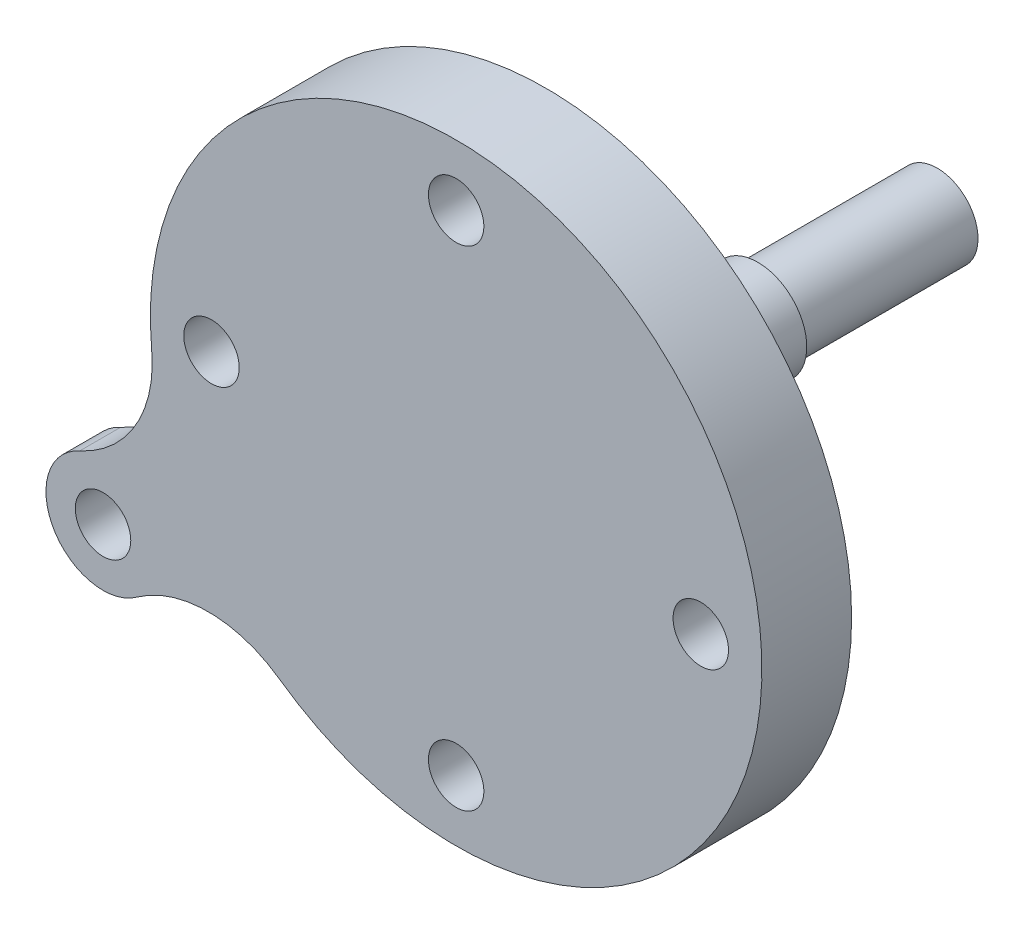
ISO-10303-21;
HEADER;
FILE_DESCRIPTION(('STEP AP214'),'2;1');
FILE_NAME('part.step','',(''),(''),'','','');
FILE_SCHEMA(('AUTOMOTIVE_DESIGN { 1 0 10303 214 1 1 1 1 }'));
ENDSEC;
DATA;
#1=APPLICATION_CONTEXT('core data for automotive mechanical design processes');
#2=APPLICATION_PROTOCOL_DEFINITION('international standard','automotive_design',2000,#1);
#3=PRODUCT_CONTEXT('',#1,'mechanical');
#4=PRODUCT('Part','Part','',(#3));
#5=PRODUCT_RELATED_PRODUCT_CATEGORY('part','',(#4));
#6=PRODUCT_DEFINITION_FORMATION('','',#4);
#7=PRODUCT_DEFINITION_CONTEXT('part definition',#1,'design');
#8=PRODUCT_DEFINITION('design','',#6,#7);
#9=PRODUCT_DEFINITION_SHAPE('','',#8);
#10=(LENGTH_UNIT() NAMED_UNIT(*) SI_UNIT(.MILLI.,.METRE.));
#11=(NAMED_UNIT(*) PLANE_ANGLE_UNIT() SI_UNIT($,.RADIAN.));
#12=(NAMED_UNIT(*) SI_UNIT($,.STERADIAN.) SOLID_ANGLE_UNIT());
#13=UNCERTAINTY_MEASURE_WITH_UNIT(LENGTH_MEASURE(1.E-05),#10,'distance_accuracy_value','');
#14=(GEOMETRIC_REPRESENTATION_CONTEXT(3) GLOBAL_UNCERTAINTY_ASSIGNED_CONTEXT((#13)) GLOBAL_UNIT_ASSIGNED_CONTEXT((#10,
#11,#12)) REPRESENTATION_CONTEXT('',''));
#15=CARTESIAN_POINT('',(0.,0.,0.));
#16=DIRECTION('',(0.,0.,1.));
#17=DIRECTION('',(1.,0.,0.));
#18=AXIS2_PLACEMENT_3D('',#15,#16,#17);
#19=CARTESIAN_POINT('',(0.,0.,11.));
#20=DIRECTION('',(0.,0.,-1.));
#21=DIRECTION('',(-1.,0.,0.));
#22=AXIS2_PLACEMENT_3D('',#19,#20,#21);
#23=CYLINDRICAL_SURFACE('',#22,37.5);
#24=CARTESIAN_POINT('',(0.,0.,0.));
#25=DIRECTION('',(0.,0.,1.));
#26=DIRECTION('',(1.,0.,0.));
#27=AXIS2_PLACEMENT_3D('',#24,#25,#26);
#28=CIRCLE('',#27,37.5);
#29=CARTESIAN_POINT('',(37.5,0.,0.));
#30=VERTEX_POINT('',#29);
#31=EDGE_CURVE('E206',#30,#30,#28,.T.);
#32=ORIENTED_EDGE('',*,*,#31,.T.);
#33=EDGE_LOOP('',(#32));
#34=FACE_BOUND('',#33,.T.);
#35=DIRECTION('',(0.,0.,1.));
#36=VECTOR('',#35,1.);
#37=CARTESIAN_POINT('',(-21.7057138285215,-30.5796008344506,6.));
#38=LINE('',#37,#36);
#39=CARTESIAN_POINT('',(-21.7057138285215,-30.5796008344506,6.));
#40=VERTEX_POINT('',#39);
#41=CARTESIAN_POINT('',(-21.7057138285215,-30.5796008344506,11.));
#42=VERTEX_POINT('',#41);
#43=EDGE_CURVE('E122',#40,#42,#38,.T.);
#44=ORIENTED_EDGE('',*,*,#43,.F.);
#45=CARTESIAN_POINT('',(0.,0.,6.));
#46=DIRECTION('',(0.,0.,-1.));
#47=DIRECTION('',(1.,0.,0.));
#48=AXIS2_PLACEMENT_3D('',#45,#46,#47);
#49=CIRCLE('',#48,37.5);
#50=CARTESIAN_POINT('',(-37.3355680744828,-3.50789916554908,6.));
#51=VERTEX_POINT('',#50);
#52=EDGE_CURVE('E108',#40,#51,#49,.T.);
#53=ORIENTED_EDGE('',*,*,#52,.T.);
#54=DIRECTION('',(0.,0.,1.));
#55=VECTOR('',#54,1.);
#56=CARTESIAN_POINT('',(-37.3355680744828,-3.50789916554908,6.));
#57=LINE('',#56,#55);
#58=CARTESIAN_POINT('',(-37.3355680744828,-3.50789916554908,11.));
#59=VERTEX_POINT('',#58);
#60=EDGE_CURVE('E128',#51,#59,#57,.T.);
#61=ORIENTED_EDGE('',*,*,#60,.T.);
#62=CARTESIAN_POINT('',(0.,0.,11.));
#63=DIRECTION('',(0.,0.,1.));
#64=DIRECTION('',(1.,0.,0.));
#65=AXIS2_PLACEMENT_3D('',#62,#63,#64);
#66=CIRCLE('',#65,37.5);
#67=EDGE_CURVE('E127',#42,#59,#66,.T.);
#68=ORIENTED_EDGE('',*,*,#67,.F.);
#69=EDGE_LOOP('',(#44,#53,#61,#68));
#70=FACE_BOUND('',#69,.T.);
#71=ADVANCED_FACE('F36',(#34,#70),#23,.T.);
#72=CARTESIAN_POINT('',(0.,0.,11.));
#73=DIRECTION('',(0.,0.,1.));
#74=DIRECTION('',(1.,0.,0.));
#75=AXIS2_PLACEMENT_3D('',#72,#73,#74);
#76=PLANE('',#75);
#77=CARTESIAN_POINT('',(-43.3012701892221,-24.9999999999998,11.));
#78=DIRECTION('',(0.,0.,1.));
#79=DIRECTION('',(1.,0.,0.));
#80=AXIS2_PLACEMENT_3D('',#77,#78,#79);
#81=CIRCLE('',#80,3.4);
#82=CARTESIAN_POINT('',(-39.9012701892221,-24.9999999999998,11.));
#83=VERTEX_POINT('',#82);
#84=EDGE_CURVE('E432',#83,#83,#81,.T.);
#85=ORIENTED_EDGE('',*,*,#84,.F.);
#86=EDGE_LOOP('',(#85));
#87=FACE_BOUND('',#86,.T.);
#88=CARTESIAN_POINT('',(0.,30.,11.));
#89=DIRECTION('',(0.,0.,1.));
#90=DIRECTION('',(1.,0.,0.));
#91=AXIS2_PLACEMENT_3D('',#88,#89,#90);
#92=CIRCLE('',#91,3.4);
#93=CARTESIAN_POINT('',(3.4,30.,11.));
#94=VERTEX_POINT('',#93);
#95=EDGE_CURVE('E182',#94,#94,#92,.T.);
#96=ORIENTED_EDGE('',*,*,#95,.F.);
#97=EDGE_LOOP('',(#96));
#98=FACE_BOUND('',#97,.T.);
#99=CARTESIAN_POINT('',(30.,0.,11.));
#100=DIRECTION('',(0.,0.,1.));
#101=DIRECTION('',(1.,0.,0.));
#102=AXIS2_PLACEMENT_3D('',#99,#100,#101);
#103=CIRCLE('',#102,3.39999999999999);
#104=CARTESIAN_POINT('',(33.4,0.,11.));
#105=VERTEX_POINT('',#104);
#106=EDGE_CURVE('E188',#105,#105,#103,.T.);
#107=ORIENTED_EDGE('',*,*,#106,.F.);
#108=EDGE_LOOP('',(#107));
#109=FACE_BOUND('',#108,.T.);
#110=CARTESIAN_POINT('',(0.,-30.,11.));
#111=DIRECTION('',(0.,0.,1.));
#112=DIRECTION('',(1.,0.,0.));
#113=AXIS2_PLACEMENT_3D('',#110,#111,#112);
#114=CIRCLE('',#113,3.4);
#115=CARTESIAN_POINT('',(3.4,-30.,11.));
#116=VERTEX_POINT('',#115);
#117=EDGE_CURVE('E194',#116,#116,#114,.T.);
#118=ORIENTED_EDGE('',*,*,#117,.F.);
#119=EDGE_LOOP('',(#118));
#120=FACE_BOUND('',#119,.T.);
#121=CARTESIAN_POINT('',(-30.,0.,11.));
#122=DIRECTION('',(0.,0.,1.));
#123=DIRECTION('',(1.,0.,0.));
#124=AXIS2_PLACEMENT_3D('',#121,#122,#123);
#125=CIRCLE('',#124,3.4);
#126=CARTESIAN_POINT('',(-26.6,0.,11.));
#127=VERTEX_POINT('',#126);
#128=EDGE_CURVE('E200',#127,#127,#125,.T.);
#129=ORIENTED_EDGE('',*,*,#128,.F.);
#130=EDGE_LOOP('',(#129));
#131=FACE_BOUND('',#130,.T.);
#132=ORIENTED_EDGE('',*,*,#67,.T.);
#133=CARTESIAN_POINT('',(-52.2697953042759,-4.91105883176871,11.));
#134=DIRECTION('',(0.,0.,-1.));
#135=DIRECTION('',(1.,0.,0.));
#136=AXIS2_PLACEMENT_3D('',#133,#134,#135);
#137=CIRCLE('',#136,15.);
#138=CARTESIAN_POINT('',(-46.1548918167392,-18.6080641737444,11.));
#139=VERTEX_POINT('',#138);
#140=EDGE_CURVE('E435',#59,#139,#137,.T.);
#141=ORIENTED_EDGE('',*,*,#140,.T.);
#142=CARTESIAN_POINT('',(-43.3012701892221,-24.9999999999998,11.));
#143=DIRECTION('',(0.,0.,1.));
#144=DIRECTION('',(1.,0.,0.));
#145=AXIS2_PLACEMENT_3D('',#142,#143,#144);
#146=CIRCLE('',#145,6.99999999999999);
#147=CARTESIAN_POINT('',(-39.1925021980837,-30.667276735346,11.));
#148=VERTEX_POINT('',#147);
#149=EDGE_CURVE('E125',#139,#148,#146,.T.);
#150=ORIENTED_EDGE('',*,*,#149,.T.);
#151=CARTESIAN_POINT('',(-30.3879993599301,-42.8114411682308,11.));
#152=DIRECTION('',(0.,0.,-1.));
#153=DIRECTION('',(1.,0.,0.));
#154=AXIS2_PLACEMENT_3D('',#151,#152,#153);
#155=CIRCLE('',#154,15.);
#156=EDGE_CURVE('E51',#148,#42,#155,.T.);
#157=ORIENTED_EDGE('',*,*,#156,.T.);
#158=EDGE_LOOP('',(#132,#141,#150,#157));
#159=FACE_BOUND('',#158,.T.);
#160=ADVANCED_FACE('F252',(#87,#98,#109,#120,#131,#159),#76,.T.);
#161=CARTESIAN_POINT('',(0.,0.,0.));
#162=DIRECTION('',(0.,0.,1.));
#163=DIRECTION('',(1.,0.,0.));
#164=AXIS2_PLACEMENT_3D('',#161,#162,#163);
#165=PLANE('',#164);
#166=CARTESIAN_POINT('',(0.,0.,0.));
#167=DIRECTION('',(0.,0.,1.));
#168=DIRECTION('',(1.,0.,0.));
#169=AXIS2_PLACEMENT_3D('',#166,#167,#168);
#170=CIRCLE('',#169,12.);
#171=CARTESIAN_POINT('',(12.,0.,0.));
#172=VERTEX_POINT('',#171);
#173=EDGE_CURVE('E179',#172,#172,#170,.F.);
#174=ORIENTED_EDGE('',*,*,#173,.F.);
#175=EDGE_LOOP('',(#174));
#176=FACE_BOUND('',#175,.T.);
#177=CARTESIAN_POINT('',(0.,30.,0.));
#178=DIRECTION('',(0.,0.,1.));
#179=DIRECTION('',(1.,0.,0.));
#180=AXIS2_PLACEMENT_3D('',#177,#178,#179);
#181=CIRCLE('',#180,3.4);
#182=CARTESIAN_POINT('',(3.4,30.,0.));
#183=VERTEX_POINT('',#182);
#184=EDGE_CURVE('E185',#183,#183,#181,.T.);
#185=ORIENTED_EDGE('',*,*,#184,.T.);
#186=EDGE_LOOP('',(#185));
#187=FACE_BOUND('',#186,.T.);
#188=CARTESIAN_POINT('',(30.,0.,0.));
#189=DIRECTION('',(0.,0.,1.));
#190=DIRECTION('',(1.,0.,0.));
#191=AXIS2_PLACEMENT_3D('',#188,#189,#190);
#192=CIRCLE('',#191,3.39999999999999);
#193=CARTESIAN_POINT('',(33.4,0.,0.));
#194=VERTEX_POINT('',#193);
#195=EDGE_CURVE('E191',#194,#194,#192,.T.);
#196=ORIENTED_EDGE('',*,*,#195,.T.);
#197=EDGE_LOOP('',(#196));
#198=FACE_BOUND('',#197,.T.);
#199=CARTESIAN_POINT('',(0.,-30.,0.));
#200=DIRECTION('',(0.,0.,1.));
#201=DIRECTION('',(1.,0.,0.));
#202=AXIS2_PLACEMENT_3D('',#199,#200,#201);
#203=CIRCLE('',#202,3.4);
#204=CARTESIAN_POINT('',(3.4,-30.,0.));
#205=VERTEX_POINT('',#204);
#206=EDGE_CURVE('E197',#205,#205,#203,.T.);
#207=ORIENTED_EDGE('',*,*,#206,.T.);
#208=EDGE_LOOP('',(#207));
#209=FACE_BOUND('',#208,.T.);
#210=CARTESIAN_POINT('',(-30.,0.,0.));
#211=DIRECTION('',(0.,0.,1.));
#212=DIRECTION('',(1.,0.,0.));
#213=AXIS2_PLACEMENT_3D('',#210,#211,#212);
#214=CIRCLE('',#213,3.4);
#215=CARTESIAN_POINT('',(-26.6,0.,0.));
#216=VERTEX_POINT('',#215);
#217=EDGE_CURVE('E203',#216,#216,#214,.T.);
#218=ORIENTED_EDGE('',*,*,#217,.T.);
#219=EDGE_LOOP('',(#218));
#220=FACE_BOUND('',#219,.T.);
#221=ORIENTED_EDGE('',*,*,#31,.F.);
#222=EDGE_LOOP('',(#221));
#223=FACE_BOUND('',#222,.T.);
#224=ADVANCED_FACE('F257',(#176,#187,#198,#209,#220,#223),#165,.F.);
#225=CARTESIAN_POINT('',(-30.,0.,11.));
#226=DIRECTION('',(0.,0.,1.));
#227=DIRECTION('',(1.,0.,0.));
#228=AXIS2_PLACEMENT_3D('',#225,#226,#227);
#229=CYLINDRICAL_SURFACE('',#228,3.4);
#230=ORIENTED_EDGE('',*,*,#128,.T.);
#231=EDGE_LOOP('',(#230));
#232=FACE_BOUND('',#231,.T.);
#233=ORIENTED_EDGE('',*,*,#217,.F.);
#234=EDGE_LOOP('',(#233));
#235=FACE_BOUND('',#234,.T.);
#236=ADVANCED_FACE('F263',(#232,#235),#229,.F.);
#237=CARTESIAN_POINT('',(0.,-30.,11.));
#238=DIRECTION('',(0.,0.,1.));
#239=DIRECTION('',(1.,0.,0.));
#240=AXIS2_PLACEMENT_3D('',#237,#238,#239);
#241=CYLINDRICAL_SURFACE('',#240,3.4);
#242=ORIENTED_EDGE('',*,*,#117,.T.);
#243=EDGE_LOOP('',(#242));
#244=FACE_BOUND('',#243,.T.);
#245=ORIENTED_EDGE('',*,*,#206,.F.);
#246=EDGE_LOOP('',(#245));
#247=FACE_BOUND('',#246,.T.);
#248=ADVANCED_FACE('F268',(#244,#247),#241,.F.);
#249=CARTESIAN_POINT('',(30.,0.,11.));
#250=DIRECTION('',(0.,0.,1.));
#251=DIRECTION('',(1.,0.,0.));
#252=AXIS2_PLACEMENT_3D('',#249,#250,#251);
#253=CYLINDRICAL_SURFACE('',#252,3.39999999999999);
#254=ORIENTED_EDGE('',*,*,#106,.T.);
#255=EDGE_LOOP('',(#254));
#256=FACE_BOUND('',#255,.T.);
#257=ORIENTED_EDGE('',*,*,#195,.F.);
#258=EDGE_LOOP('',(#257));
#259=FACE_BOUND('',#258,.T.);
#260=ADVANCED_FACE('F276',(#256,#259),#253,.F.);
#261=CARTESIAN_POINT('',(0.,30.,11.));
#262=DIRECTION('',(0.,0.,1.));
#263=DIRECTION('',(1.,0.,0.));
#264=AXIS2_PLACEMENT_3D('',#261,#262,#263);
#265=CYLINDRICAL_SURFACE('',#264,3.4);
#266=ORIENTED_EDGE('',*,*,#95,.T.);
#267=EDGE_LOOP('',(#266));
#268=FACE_BOUND('',#267,.T.);
#269=ORIENTED_EDGE('',*,*,#184,.F.);
#270=EDGE_LOOP('',(#269));
#271=FACE_BOUND('',#270,.T.);
#272=ADVANCED_FACE('F280',(#268,#271),#265,.F.);
#273=CARTESIAN_POINT('',(0.,0.,-1.));
#274=DIRECTION('',(0.,0.,1.));
#275=DIRECTION('',(1.,0.,0.));
#276=AXIS2_PLACEMENT_3D('',#273,#274,#275);
#277=CYLINDRICAL_SURFACE('',#276,12.);
#278=CARTESIAN_POINT('',(0.,0.,-1.));
#279=DIRECTION('',(0.,0.,-1.));
#280=DIRECTION('',(-1.,0.,0.));
#281=AXIS2_PLACEMENT_3D('',#278,#279,#280);
#282=CIRCLE('',#281,12.);
#283=CARTESIAN_POINT('',(-12.,0.,-1.));
#284=VERTEX_POINT('',#283);
#285=EDGE_CURVE('E176',#284,#284,#282,.T.);
#286=ORIENTED_EDGE('',*,*,#285,.F.);
#287=EDGE_LOOP('',(#286));
#288=FACE_BOUND('',#287,.T.);
#289=ORIENTED_EDGE('',*,*,#173,.T.);
#290=EDGE_LOOP('',(#289));
#291=FACE_BOUND('',#290,.T.);
#292=ADVANCED_FACE('F284',(#288,#291),#277,.T.);
#293=CARTESIAN_POINT('',(0.,0.,-1.));
#294=DIRECTION('',(0.,0.,-1.));
#295=DIRECTION('',(-1.,0.,0.));
#296=AXIS2_PLACEMENT_3D('',#293,#294,#295);
#297=PLANE('',#296);
#298=CARTESIAN_POINT('',(0.,0.,-1.));
#299=DIRECTION('',(0.,0.,-1.));
#300=DIRECTION('',(-1.,0.,0.));
#301=AXIS2_PLACEMENT_3D('',#298,#299,#300);
#302=CIRCLE('',#301,10.);
#303=CARTESIAN_POINT('',(-10.,0.,-1.));
#304=VERTEX_POINT('',#303);
#305=EDGE_CURVE('E173',#304,#304,#302,.T.);
#306=ORIENTED_EDGE('',*,*,#305,.F.);
#307=EDGE_LOOP('',(#306));
#308=FACE_BOUND('',#307,.T.);
#309=ORIENTED_EDGE('',*,*,#285,.T.);
#310=EDGE_LOOP('',(#309));
#311=FACE_BOUND('',#310,.T.);
#312=ADVANCED_FACE('F288',(#308,#311),#297,.T.);
#313=CARTESIAN_POINT('',(0.,0.,-12.));
#314=DIRECTION('',(0.,0.,1.));
#315=DIRECTION('',(1.,0.,0.));
#316=AXIS2_PLACEMENT_3D('',#313,#314,#315);
#317=CYLINDRICAL_SURFACE('',#316,10.);
#318=CARTESIAN_POINT('',(0.,0.,-12.));
#319=DIRECTION('',(0.,0.,-1.));
#320=DIRECTION('',(-1.,0.,0.));
#321=AXIS2_PLACEMENT_3D('',#318,#319,#320);
#322=CIRCLE('',#321,10.);
#323=CARTESIAN_POINT('',(-10.,0.,-12.));
#324=VERTEX_POINT('',#323);
#325=EDGE_CURVE('E170',#324,#324,#322,.T.);
#326=ORIENTED_EDGE('',*,*,#325,.F.);
#327=EDGE_LOOP('',(#326));
#328=FACE_BOUND('',#327,.T.);
#329=ORIENTED_EDGE('',*,*,#305,.T.);
#330=EDGE_LOOP('',(#329));
#331=FACE_BOUND('',#330,.T.);
#332=ADVANCED_FACE('F292',(#328,#331),#317,.T.);
#333=CARTESIAN_POINT('',(0.,0.,-12.));
#334=DIRECTION('',(0.,0.,-1.));
#335=DIRECTION('',(-1.,0.,0.));
#336=AXIS2_PLACEMENT_3D('',#333,#334,#335);
#337=PLANE('',#336);
#338=CARTESIAN_POINT('',(0.,0.,-12.));
#339=DIRECTION('',(0.,0.,-1.));
#340=DIRECTION('',(-1.,0.,0.));
#341=AXIS2_PLACEMENT_3D('',#338,#339,#340);
#342=CIRCLE('',#341,6.);
#343=CARTESIAN_POINT('',(-6.,0.,-12.));
#344=VERTEX_POINT('',#343);
#345=EDGE_CURVE('E167',#344,#344,#342,.T.);
#346=ORIENTED_EDGE('',*,*,#345,.F.);
#347=EDGE_LOOP('',(#346));
#348=FACE_BOUND('',#347,.T.);
#349=ORIENTED_EDGE('',*,*,#325,.T.);
#350=EDGE_LOOP('',(#349));
#351=FACE_BOUND('',#350,.T.);
#352=ADVANCED_FACE('F296',(#348,#351),#337,.T.);
#353=CARTESIAN_POINT('',(0.,0.,-26.));
#354=DIRECTION('',(0.,0.,1.));
#355=DIRECTION('',(1.,0.,0.));
#356=AXIS2_PLACEMENT_3D('',#353,#354,#355);
#357=CYLINDRICAL_SURFACE('',#356,6.);
#358=CARTESIAN_POINT('',(0.,0.,-26.));
#359=DIRECTION('',(0.,0.,-1.));
#360=DIRECTION('',(-1.,0.,0.));
#361=AXIS2_PLACEMENT_3D('',#358,#359,#360);
#362=CIRCLE('',#361,6.);
#363=CARTESIAN_POINT('',(-6.,0.,-26.));
#364=VERTEX_POINT('',#363);
#365=EDGE_CURVE('E162',#364,#364,#362,.T.);
#366=ORIENTED_EDGE('',*,*,#365,.F.);
#367=EDGE_LOOP('',(#366));
#368=FACE_BOUND('',#367,.T.);
#369=ORIENTED_EDGE('',*,*,#345,.T.);
#370=EDGE_LOOP('',(#369));
#371=FACE_BOUND('',#370,.T.);
#372=ADVANCED_FACE('F300',(#368,#371),#357,.T.);
#373=CARTESIAN_POINT('',(0.,0.,-26.));
#374=DIRECTION('',(0.,0.,-1.));
#375=DIRECTION('',(-1.,0.,0.));
#376=AXIS2_PLACEMENT_3D('',#373,#374,#375);
#377=PLANE('',#376);
#378=CARTESIAN_POINT('',(0.,0.,-26.));
#379=DIRECTION('',(0.,0.,-1.));
#380=DIRECTION('',(-1.,0.,0.));
#381=AXIS2_PLACEMENT_3D('',#378,#379,#380);
#382=CIRCLE('',#381,5.);
#383=CARTESIAN_POINT('',(-5.,0.,-26.));
#384=VERTEX_POINT('',#383);
#385=EDGE_CURVE('E163',#384,#384,#382,.T.);
#386=ORIENTED_EDGE('',*,*,#385,.F.);
#387=EDGE_LOOP('',(#386));
#388=FACE_BOUND('',#387,.T.);
#389=ORIENTED_EDGE('',*,*,#365,.T.);
#390=EDGE_LOOP('',(#389));
#391=FACE_BOUND('',#390,.T.);
#392=ADVANCED_FACE('F247',(#388,#391),#377,.T.);
#393=CARTESIAN_POINT('',(0.,0.,-48.));
#394=DIRECTION('',(0.,0.,1.));
#395=DIRECTION('',(1.,0.,0.));
#396=AXIS2_PLACEMENT_3D('',#393,#394,#395);
#397=CYLINDRICAL_SURFACE('',#396,5.);
#398=CARTESIAN_POINT('',(0.,0.,-48.));
#399=DIRECTION('',(0.,0.,-1.));
#400=DIRECTION('',(-1.,0.,0.));
#401=AXIS2_PLACEMENT_3D('',#398,#399,#400);
#402=CIRCLE('',#401,5.);
#403=CARTESIAN_POINT('',(-1.5,-4.76969600708473,-48.));
#404=VERTEX_POINT('',#403);
#405=CARTESIAN_POINT('',(1.5,-4.76969600708473,-48.));
#406=VERTEX_POINT('',#405);
#407=EDGE_CURVE('E159',#404,#406,#402,.T.);
#408=ORIENTED_EDGE('',*,*,#407,.F.);
#409=DIRECTION('',(0.,0.,1.));
#410=VECTOR('',#409,1.);
#411=CARTESIAN_POINT('',(-1.5,-4.76969600708473,-48.));
#412=LINE('',#411,#410);
#413=CARTESIAN_POINT('',(-1.5,-4.76969600708473,-27.9239886957043));
#414=VERTEX_POINT('',#413);
#415=EDGE_CURVE('E150',#404,#414,#412,.T.);
#416=ORIENTED_EDGE('',*,*,#415,.T.);
#417=CARTESIAN_POINT('',(-1.5,-4.76969600708473,-27.9239886957043));
#418=CARTESIAN_POINT('',(-1.50000085357071,-4.76969249084934,-27.8828093027963));
#419=CARTESIAN_POINT('',(-1.49830317083428,-4.77022997000129,-27.8416506525782));
#420=CARTESIAN_POINT('',(-1.49153785660317,-4.77235095109999,-27.7596475336088));
#421=CARTESIAN_POINT('',(-1.48647098275841,-4.77393421787376,-27.7188029963094));
#422=CARTESIAN_POINT('',(-1.46630203689311,-4.78018490618873,-27.5973981547497));
#423=CARTESIAN_POINT('',(-1.44623120413662,-4.78635370384275,-27.517682305288));
#424=CARTESIAN_POINT('',(-1.39353102315626,-4.80195952113208,-27.3629531173185));
#425=CARTESIAN_POINT('',(-1.36090607068203,-4.81139539670393,-27.2879381435063));
#426=CARTESIAN_POINT('',(-1.28407841117655,-4.83246571212052,-27.1443920141067));
#427=CARTESIAN_POINT('',(-1.23987031651226,-4.84410117434933,-27.0758638959759));
#428=CARTESIAN_POINT('',(-1.13964850658326,-4.86866835244721,-26.9451226397073));
#429=CARTESIAN_POINT('',(-1.08333433465208,-4.88162755412974,-26.8831450353609));
#430=CARTESIAN_POINT('',(-0.961138919873354,-4.90714811559049,-26.7693531118044));
#431=CARTESIAN_POINT('',(-0.895256063916348,-4.91970940785249,-26.7175405097013));
#432=CARTESIAN_POINT('',(-0.75410992131543,-4.94333239727705,-26.6245249253858));
#433=CARTESIAN_POINT('',(-0.678680819336259,-4.95435770971354,-26.5835635154064));
#434=CARTESIAN_POINT('',(-0.521621185505774,-4.97334469846208,-26.5150002840862));
#435=CARTESIAN_POINT('',(-0.439992259012927,-4.98130716463903,-26.4873950179101));
#436=CARTESIAN_POINT('',(-0.275324697874877,-4.99307639935002,-26.4471088966023));
#437=CARTESIAN_POINT('',(-0.192393125294253,-4.99699549276993,-26.4340238377346));
#438=CARTESIAN_POINT('',(-0.0254235719980811,-5.00063202022426,-26.4218713543411));
#439=CARTESIAN_POINT('',(0.0586141962423631,-5.00035024971471,-26.4228012760042));
#440=CARTESIAN_POINT('',(0.222571599946018,-4.99569602566267,-26.4383816044633));
#441=CARTESIAN_POINT('',(0.302537145464642,-4.99145415509187,-26.4525940406831));
#442=CARTESIAN_POINT('',(0.458890052102027,-4.9795151369998,-26.4936203309424));
#443=CARTESIAN_POINT('',(0.535277225531999,-4.97181780846028,-26.5204348451603));
#444=CARTESIAN_POINT('',(0.683347815892218,-4.95365214926145,-26.5862009173508));
#445=CARTESIAN_POINT('',(0.754966006044144,-4.94315255692525,-26.6252903400613));
#446=CARTESIAN_POINT('',(0.890765529574422,-4.92049624651755,-26.7143872857527));
#447=CARTESIAN_POINT('',(0.954945191614597,-4.90833915735884,-26.7643972551832));
#448=CARTESIAN_POINT('',(1.07665450541275,-4.88311673571409,-26.8761806837878));
#449=CARTESIAN_POINT('',(1.13383351478034,-4.87003445449554,-26.9383325594651));
#450=CARTESIAN_POINT('',(1.23706769492487,-4.84484215114658,-27.0714861191323));
#451=CARTESIAN_POINT('',(1.28311962013078,-4.83273241337565,-27.1424903760699));
#452=CARTESIAN_POINT('',(1.36316407240863,-4.81077228795653,-27.2922696241536));
#453=CARTESIAN_POINT('',(1.39703006341135,-4.80094596245948,-27.3711158752977));
#454=CARTESIAN_POINT('',(1.45085886004699,-4.78495663653201,-27.5337131996861));
#455=CARTESIAN_POINT('',(1.47084293218035,-4.77878803475875,-27.6174565564187));
#456=CARTESIAN_POINT('',(1.4890120359008,-4.77314032325006,-27.7389835847745));
#457=CARTESIAN_POINT('',(1.49313202989009,-4.77185156275267,-27.7758794298839));
#458=CARTESIAN_POINT('',(1.49862355614854,-4.77012928611782,-27.8498401748039));
#459=CARTESIAN_POINT('',(1.49999912968269,-4.76969451246644,-27.8869047453682));
#460=CARTESIAN_POINT('',(1.5,-4.76969600708473,-27.9239886957043));
#461=B_SPLINE_CURVE_WITH_KNOTS('',3,(#417,#418,#419,#420,#421,#422,#423,#424,#425,#426,#427,
#428,#429,#430,#431,#432,#433,#434,#435,#436,#437,#438,#439,#440,#441,#442,#443,#444,#445,#446,
#447,#448,#449,#450,#451,#452,#453,#454,#455,#456,#457,#458,#459,#460),.UNSPECIFIED.,.F.,.F.,(4,
2,2,2,2,2,2,2,2,2,2,2,2,2,2,2,2,2,2,2,2,4),(0.,0.123459071219734,0.246890388853047,
0.492911349615212,0.738846245884326,0.984895736828095,1.23795510798803,1.49105719006936,
1.74939356197455,2.00766326783256,2.25854751319802,2.5093842528947,2.75223130012966,
2.99509107067836,3.24078242562731,3.48652887757005,3.74172568310981,3.99699683536777,
4.25484698071527,4.51230123440207,4.62365084745809,4.73483637253615),.UNSPECIFIED.);
#462=CARTESIAN_POINT('',(1.5,-4.76969600708473,-27.9239886957043));
#463=VERTEX_POINT('',#462);
#464=EDGE_CURVE('E11',#414,#463,#461,.T.);
#465=ORIENTED_EDGE('',*,*,#464,.T.);
#466=DIRECTION('',(0.,0.,1.));
#467=VECTOR('',#466,1.);
#468=CARTESIAN_POINT('',(1.5,-4.76969600708473,-48.));
#469=LINE('',#468,#467);
#470=EDGE_CURVE('E146',#463,#406,#469,.F.);
#471=ORIENTED_EDGE('',*,*,#470,.T.);
#472=EDGE_LOOP('',(#408,#416,#465,#471));
#473=FACE_BOUND('',#472,.T.);
#474=ORIENTED_EDGE('',*,*,#385,.T.);
#475=EDGE_LOOP('',(#474));
#476=FACE_BOUND('',#475,.T.);
#477=ADVANCED_FACE('F221',(#473,#476),#397,.T.);
#478=CARTESIAN_POINT('',(0.,0.,-48.));
#479=DIRECTION('',(0.,0.,-1.));
#480=DIRECTION('',(-1.,0.,0.));
#481=AXIS2_PLACEMENT_3D('',#478,#479,#480);
#482=PLANE('',#481);
#483=DIRECTION('',(0.,1.,0.));
#484=VECTOR('',#483,1.);
#485=CARTESIAN_POINT('',(-1.5,-13.2,-48.));
#486=LINE('',#485,#484);
#487=CARTESIAN_POINT('',(-1.5,-3.2,-48.));
#488=VERTEX_POINT('',#487);
#489=EDGE_CURVE('E44',#404,#488,#486,.T.);
#490=ORIENTED_EDGE('',*,*,#489,.F.);
#491=ORIENTED_EDGE('',*,*,#407,.T.);
#492=DIRECTION('',(0.,-1.,0.));
#493=VECTOR('',#492,1.);
#494=CARTESIAN_POINT('',(1.5,0.,-48.));
#495=LINE('',#494,#493);
#496=CARTESIAN_POINT('',(1.5,-3.2,-48.));
#497=VERTEX_POINT('',#496);
#498=EDGE_CURVE('E213',#497,#406,#495,.T.);
#499=ORIENTED_EDGE('',*,*,#498,.F.);
#500=DIRECTION('',(1.,0.,0.));
#501=VECTOR('',#500,1.);
#502=CARTESIAN_POINT('',(0.,-3.2,-48.));
#503=LINE('',#502,#501);
#504=EDGE_CURVE('E166',#488,#497,#503,.T.);
#505=ORIENTED_EDGE('',*,*,#504,.F.);
#506=EDGE_LOOP('',(#490,#491,#499,#505));
#507=FACE_BOUND('',#506,.T.);
#508=CARTESIAN_POINT('',(0.,0.,-48.));
#509=DIRECTION('',(0.,0.,-1.));
#510=DIRECTION('',(-1.,0.,0.));
#511=AXIS2_PLACEMENT_3D('',#508,#509,#510);
#512=CIRCLE('',#511,2.5);
#513=CARTESIAN_POINT('',(-2.5,0.,-48.));
#514=VERTEX_POINT('',#513);
#515=EDGE_CURVE('E153',#514,#514,#512,.T.);
#516=ORIENTED_EDGE('',*,*,#515,.F.);
#517=EDGE_LOOP('',(#516));
#518=FACE_BOUND('',#517,.T.);
#519=ADVANCED_FACE('F240',(#507,#518),#482,.T.);
#520=CARTESIAN_POINT('',(0.,0.,-25.));
#521=DIRECTION('',(0.,0.,-1.));
#522=DIRECTION('',(-1.,0.,0.));
#523=AXIS2_PLACEMENT_3D('',#520,#521,#522);
#524=CONICAL_SURFACE('',#523,2.49999999999999,1.02974425867665);
#525=CARTESIAN_POINT('',(0.,0.,-23.4978484524311));
#526=VERTEX_POINT('',#525);
#527=VERTEX_LOOP('',#526);
#528=FACE_BOUND('',#527,.T.);
#529=CARTESIAN_POINT('',(0.,0.,-25.));
#530=DIRECTION('',(0.,0.,-1.));
#531=DIRECTION('',(-1.,0.,0.));
#532=AXIS2_PLACEMENT_3D('',#529,#530,#531);
#533=CIRCLE('',#532,2.49999999999999);
#534=CARTESIAN_POINT('',(-2.49999999999999,0.,-25.));
#535=VERTEX_POINT('',#534);
#536=EDGE_CURVE('E156',#535,#535,#533,.T.);
#537=ORIENTED_EDGE('',*,*,#536,.T.);
#538=EDGE_LOOP('',(#537));
#539=FACE_BOUND('',#538,.T.);
#540=ADVANCED_FACE('F237',(#528,#539),#524,.F.);
#541=CARTESIAN_POINT('',(0.,0.,-48.));
#542=DIRECTION('',(0.,0.,-1.));
#543=DIRECTION('',(-1.,0.,0.));
#544=AXIS2_PLACEMENT_3D('',#541,#542,#543);
#545=CYLINDRICAL_SURFACE('',#544,2.5);
#546=ORIENTED_EDGE('',*,*,#536,.F.);
#547=EDGE_LOOP('',(#546));
#548=FACE_BOUND('',#547,.T.);
#549=ORIENTED_EDGE('',*,*,#515,.T.);
#550=EDGE_LOOP('',(#549));
#551=FACE_BOUND('',#550,.T.);
#552=ADVANCED_FACE('F231',(#548,#551),#545,.F.);
#553=CARTESIAN_POINT('',(0.,-13.2,-27.9239886957043));
#554=DIRECTION('',(0.,1.,0.));
#555=DIRECTION('',(0.,0.,1.));
#556=AXIS2_PLACEMENT_3D('',#553,#554,#555);
#557=CYLINDRICAL_SURFACE('',#556,1.5);
#558=DIRECTION('',(0.,1.,0.));
#559=VECTOR('',#558,1.);
#560=CARTESIAN_POINT('',(-1.5,-13.2,-27.9239886957043));
#561=LINE('',#560,#559);
#562=CARTESIAN_POINT('',(-1.5,-3.2,-27.9239886957043));
#563=VERTEX_POINT('',#562);
#564=EDGE_CURVE('E144',#414,#563,#561,.T.);
#565=ORIENTED_EDGE('',*,*,#564,.T.);
#566=CARTESIAN_POINT('',(0.,-3.2,-27.9239886957043));
#567=DIRECTION('',(0.,1.,0.));
#568=DIRECTION('',(0.,0.,1.));
#569=AXIS2_PLACEMENT_3D('',#566,#567,#568);
#570=CIRCLE('',#569,1.5);
#571=CARTESIAN_POINT('',(1.5,-3.2,-27.9239886957043));
#572=VERTEX_POINT('',#571);
#573=EDGE_CURVE('E136',#563,#572,#570,.T.);
#574=ORIENTED_EDGE('',*,*,#573,.T.);
#575=DIRECTION('',(0.,1.,0.));
#576=VECTOR('',#575,1.);
#577=CARTESIAN_POINT('',(1.5,-13.2,-27.9239886957043));
#578=LINE('',#577,#576);
#579=EDGE_CURVE('E143',#463,#572,#578,.T.);
#580=ORIENTED_EDGE('',*,*,#579,.F.);
#581=ORIENTED_EDGE('',*,*,#464,.F.);
#582=EDGE_LOOP('',(#565,#574,#580,#581));
#583=FACE_BOUND('',#582,.T.);
#584=ADVANCED_FACE('F225',(#583),#557,.F.);
#585=CARTESIAN_POINT('',(-1.5,-13.2,-27.9239886957043));
#586=DIRECTION('',(-1.,0.,0.));
#587=DIRECTION('',(0.,0.,1.));
#588=AXIS2_PLACEMENT_3D('',#585,#586,#587);
#589=PLANE('',#588);
#590=ORIENTED_EDGE('',*,*,#489,.T.);
#591=DIRECTION('',(0.,0.,1.));
#592=VECTOR('',#591,1.);
#593=CARTESIAN_POINT('',(-1.5,-3.2,-27.9239886957043));
#594=LINE('',#593,#592);
#595=EDGE_CURVE('E59',#488,#563,#594,.T.);
#596=ORIENTED_EDGE('',*,*,#595,.T.);
#597=ORIENTED_EDGE('',*,*,#564,.F.);
#598=ORIENTED_EDGE('',*,*,#415,.F.);
#599=EDGE_LOOP('',(#590,#596,#597,#598));
#600=FACE_BOUND('',#599,.T.);
#601=ADVANCED_FACE('F230',(#600),#589,.F.);
#602=CARTESIAN_POINT('',(1.5,-13.2,-27.9239886957043));
#603=DIRECTION('',(1.,0.,0.));
#604=DIRECTION('',(0.,0.,-1.));
#605=AXIS2_PLACEMENT_3D('',#602,#603,#604);
#606=PLANE('',#605);
#607=ORIENTED_EDGE('',*,*,#579,.T.);
#608=DIRECTION('',(0.,0.,-1.));
#609=VECTOR('',#608,1.);
#610=CARTESIAN_POINT('',(1.5,-3.2,-27.9239886957043));
#611=LINE('',#610,#609);
#612=EDGE_CURVE('E139',#572,#497,#611,.T.);
#613=ORIENTED_EDGE('',*,*,#612,.T.);
#614=ORIENTED_EDGE('',*,*,#498,.T.);
#615=ORIENTED_EDGE('',*,*,#470,.F.);
#616=EDGE_LOOP('',(#607,#613,#614,#615));
#617=FACE_BOUND('',#616,.T.);
#618=ADVANCED_FACE('F233',(#617),#606,.F.);
#619=CARTESIAN_POINT('',(0.,-3.2,-27.9239886957043));
#620=DIRECTION('',(0.,1.,0.));
#621=DIRECTION('',(0.,0.,1.));
#622=AXIS2_PLACEMENT_3D('',#619,#620,#621);
#623=PLANE('',#622);
#624=ORIENTED_EDGE('',*,*,#504,.T.);
#625=ORIENTED_EDGE('',*,*,#612,.F.);
#626=ORIENTED_EDGE('',*,*,#573,.F.);
#627=ORIENTED_EDGE('',*,*,#595,.F.);
#628=EDGE_LOOP('',(#624,#625,#626,#627));
#629=FACE_BOUND('',#628,.T.);
#630=ADVANCED_FACE('F359',(#629),#623,.F.);
#631=CARTESIAN_POINT('',(-30.3879993599301,-42.8114411682308,6.));
#632=DIRECTION('',(0.,0.,1.));
#633=DIRECTION('',(1.,0.,0.));
#634=AXIS2_PLACEMENT_3D('',#631,#632,#633);
#635=CYLINDRICAL_SURFACE('',#634,15.);
#636=ORIENTED_EDGE('',*,*,#156,.F.);
#637=DIRECTION('',(0.,0.,1.));
#638=VECTOR('',#637,1.);
#639=CARTESIAN_POINT('',(-39.1925021980837,-30.667276735346,6.));
#640=LINE('',#639,#638);
#641=CARTESIAN_POINT('',(-39.1925021980837,-30.667276735346,6.));
#642=VERTEX_POINT('',#641);
#643=EDGE_CURVE('E124',#642,#148,#640,.T.);
#644=ORIENTED_EDGE('',*,*,#643,.F.);
#645=CARTESIAN_POINT('',(-30.3879993599301,-42.8114411682308,6.));
#646=DIRECTION('',(0.,0.,-1.));
#647=DIRECTION('',(1.,0.,0.));
#648=AXIS2_PLACEMENT_3D('',#645,#646,#647);
#649=CIRCLE('',#648,15.);
#650=EDGE_CURVE('E112',#642,#40,#649,.T.);
#651=ORIENTED_EDGE('',*,*,#650,.T.);
#652=ORIENTED_EDGE('',*,*,#43,.T.);
#653=EDGE_LOOP('',(#636,#644,#651,#652));
#654=FACE_BOUND('',#653,.T.);
#655=ADVANCED_FACE('F121',(#654),#635,.F.);
#656=CARTESIAN_POINT('',(-43.3012701892221,-24.9999999999998,6.));
#657=DIRECTION('',(0.,0.,1.));
#658=DIRECTION('',(1.,0.,0.));
#659=AXIS2_PLACEMENT_3D('',#656,#657,#658);
#660=CYLINDRICAL_SURFACE('',#659,6.99999999999999);
#661=ORIENTED_EDGE('',*,*,#149,.F.);
#662=DIRECTION('',(0.,0.,1.));
#663=VECTOR('',#662,1.);
#664=CARTESIAN_POINT('',(-46.1548918167392,-18.6080641737444,6.));
#665=LINE('',#664,#663);
#666=CARTESIAN_POINT('',(-46.1548918167392,-18.6080641737444,6.));
#667=VERTEX_POINT('',#666);
#668=EDGE_CURVE('E131',#667,#139,#665,.T.);
#669=ORIENTED_EDGE('',*,*,#668,.F.);
#670=CARTESIAN_POINT('',(-43.3012701892221,-24.9999999999998,6.));
#671=DIRECTION('',(0.,0.,1.));
#672=DIRECTION('',(1.,0.,0.));
#673=AXIS2_PLACEMENT_3D('',#670,#671,#672);
#674=CIRCLE('',#673,6.99999999999999);
#675=EDGE_CURVE('E129',#667,#642,#674,.T.);
#676=ORIENTED_EDGE('',*,*,#675,.T.);
#677=ORIENTED_EDGE('',*,*,#643,.T.);
#678=EDGE_LOOP('',(#661,#669,#676,#677));
#679=FACE_BOUND('',#678,.T.);
#680=ADVANCED_FACE('F381',(#679),#660,.T.);
#681=CARTESIAN_POINT('',(-52.2697953042759,-4.91105883176871,6.));
#682=DIRECTION('',(0.,0.,1.));
#683=DIRECTION('',(1.,0.,0.));
#684=AXIS2_PLACEMENT_3D('',#681,#682,#683);
#685=CYLINDRICAL_SURFACE('',#684,15.);
#686=ORIENTED_EDGE('',*,*,#140,.F.);
#687=ORIENTED_EDGE('',*,*,#60,.F.);
#688=CARTESIAN_POINT('',(-52.2697953042759,-4.91105883176871,6.));
#689=DIRECTION('',(0.,0.,-1.));
#690=DIRECTION('',(1.,0.,0.));
#691=AXIS2_PLACEMENT_3D('',#688,#689,#690);
#692=CIRCLE('',#691,15.);
#693=EDGE_CURVE('E115',#51,#667,#692,.T.);
#694=ORIENTED_EDGE('',*,*,#693,.T.);
#695=ORIENTED_EDGE('',*,*,#668,.T.);
#696=EDGE_LOOP('',(#686,#687,#694,#695));
#697=FACE_BOUND('',#696,.T.);
#698=ADVANCED_FACE('F390',(#697),#685,.F.);
#699=CARTESIAN_POINT('',(-36.8446347745761,-33.9057205841153,6.));
#700=DIRECTION('',(0.,0.,1.));
#701=DIRECTION('',(1.,0.,0.));
#702=AXIS2_PLACEMENT_3D('',#699,#700,#701);
#703=PLANE('',#702);
#704=CARTESIAN_POINT('',(-43.3012701892221,-24.9999999999998,6.));
#705=DIRECTION('',(0.,0.,1.));
#706=DIRECTION('',(1.,0.,0.));
#707=AXIS2_PLACEMENT_3D('',#704,#705,#706);
#708=CIRCLE('',#707,3.4);
#709=CARTESIAN_POINT('',(-39.9012701892221,-24.9999999999998,6.));
#710=VERTEX_POINT('',#709);
#711=EDGE_CURVE('E39',#710,#710,#708,.T.);
#712=ORIENTED_EDGE('',*,*,#711,.T.);
#713=EDGE_LOOP('',(#712));
#714=FACE_BOUND('',#713,.T.);
#715=ORIENTED_EDGE('',*,*,#650,.F.);
#716=ORIENTED_EDGE('',*,*,#675,.F.);
#717=ORIENTED_EDGE('',*,*,#693,.F.);
#718=ORIENTED_EDGE('',*,*,#52,.F.);
#719=EDGE_LOOP('',(#715,#716,#717,#718));
#720=FACE_BOUND('',#719,.T.);
#721=ADVANCED_FACE('F110',(#714,#720),#703,.F.);
#722=CARTESIAN_POINT('',(-43.3012701892221,-24.9999999999998,11.));
#723=DIRECTION('',(0.,0.,1.));
#724=DIRECTION('',(1.,0.,0.));
#725=AXIS2_PLACEMENT_3D('',#722,#723,#724);
#726=CYLINDRICAL_SURFACE('',#725,3.4);
#727=ORIENTED_EDGE('',*,*,#84,.T.);
#728=EDGE_LOOP('',(#727));
#729=FACE_BOUND('',#728,.T.);
#730=ORIENTED_EDGE('',*,*,#711,.F.);
#731=EDGE_LOOP('',(#730));
#732=FACE_BOUND('',#731,.T.);
#733=ADVANCED_FACE('F415',(#729,#732),#726,.F.);
#734=CLOSED_SHELL('',(#71,#160,#224,#236,#248,#260,#272,#292,#312,#332,#352,#372,#392,#477,#519,
#540,#552,#584,#601,#618,#630,#655,#680,#698,#721,#733));
#735=MANIFOLD_SOLID_BREP('B2',#734);
#736=ADVANCED_BREP_SHAPE_REPRESENTATION('',(#18,#735),#14);
#737=SHAPE_DEFINITION_REPRESENTATION(#9,#736);
ENDSEC;
END-ISO-10303-21;
